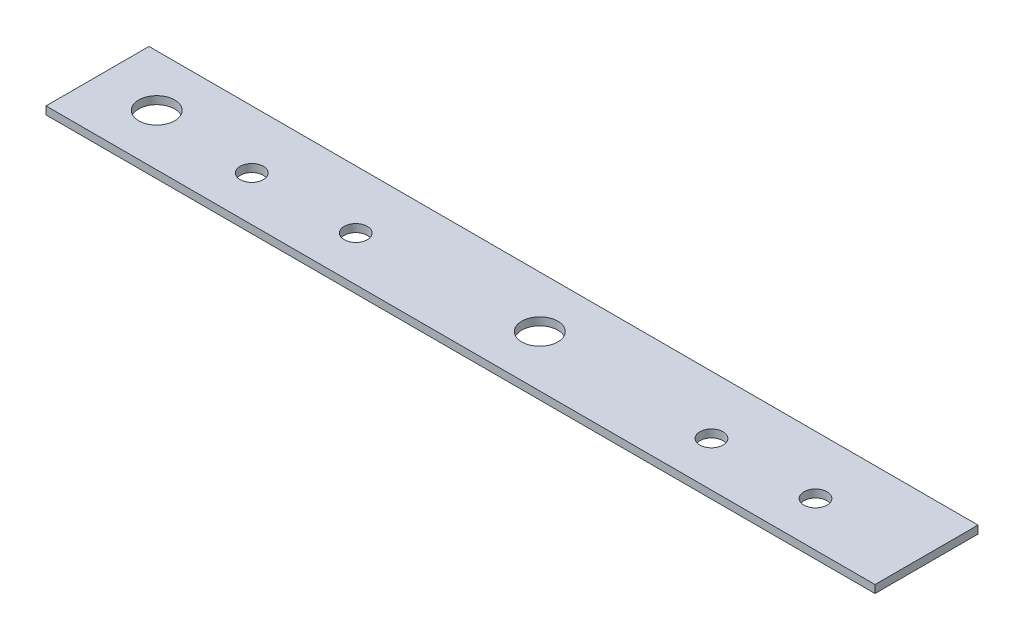
ISO-10303-21;
HEADER;
FILE_DESCRIPTION(('STEP AP214'),'2;1');
FILE_NAME('part.step','',(''),(''),'','','');
FILE_SCHEMA(('AUTOMOTIVE_DESIGN { 1 0 10303 214 1 1 1 1 }'));
ENDSEC;
DATA;
#1=APPLICATION_CONTEXT('core data for automotive mechanical design processes');
#2=APPLICATION_PROTOCOL_DEFINITION('international standard','automotive_design',2000,#1);
#3=PRODUCT_CONTEXT('',#1,'mechanical');
#4=PRODUCT('Part','Part','',(#3));
#5=PRODUCT_RELATED_PRODUCT_CATEGORY('part','',(#4));
#6=PRODUCT_DEFINITION_FORMATION('','',#4);
#7=PRODUCT_DEFINITION_CONTEXT('part definition',#1,'design');
#8=PRODUCT_DEFINITION('design','',#6,#7);
#9=PRODUCT_DEFINITION_SHAPE('','',#8);
#10=(LENGTH_UNIT() NAMED_UNIT(*) SI_UNIT(.MILLI.,.METRE.));
#11=(NAMED_UNIT(*) PLANE_ANGLE_UNIT() SI_UNIT($,.RADIAN.));
#12=(NAMED_UNIT(*) SI_UNIT($,.STERADIAN.) SOLID_ANGLE_UNIT());
#13=UNCERTAINTY_MEASURE_WITH_UNIT(LENGTH_MEASURE(1.E-05),#10,'distance_accuracy_value','');
#14=(GEOMETRIC_REPRESENTATION_CONTEXT(3) GLOBAL_UNCERTAINTY_ASSIGNED_CONTEXT((#13)) GLOBAL_UNIT_ASSIGNED_CONTEXT((#10,
#11,#12)) REPRESENTATION_CONTEXT('',''));
#15=CARTESIAN_POINT('',(0.,0.,0.));
#16=DIRECTION('',(0.,0.,1.));
#17=DIRECTION('',(1.,0.,0.));
#18=AXIS2_PLACEMENT_3D('',#15,#16,#17);
#19=CARTESIAN_POINT('',(40.25,0.38,5.));
#20=DIRECTION('',(0.,1.,0.));
#21=DIRECTION('',(0.,0.,1.));
#22=AXIS2_PLACEMENT_3D('',#19,#20,#21);
#23=PLANE('',#22);
#24=CARTESIAN_POINT('',(20.02,0.38,0.65));
#25=DIRECTION('',(0.,1.,0.));
#26=DIRECTION('',(0.,0.,1.));
#27=AXIS2_PLACEMENT_3D('',#24,#25,#26);
#28=CIRCLE('',#27,1.125);
#29=CARTESIAN_POINT('',(20.02,0.38,1.775));
#30=VERTEX_POINT('',#29);
#31=EDGE_CURVE('E133',#30,#30,#28,.T.);
#32=ORIENTED_EDGE('',*,*,#31,.F.);
#33=EDGE_LOOP('',(#32));
#34=FACE_BOUND('',#33,.T.);
#35=CARTESIAN_POINT('',(-24.62,0.38,0.65));
#36=DIRECTION('',(0.,1.,0.));
#37=DIRECTION('',(0.,0.,1.));
#38=AXIS2_PLACEMENT_3D('',#35,#36,#37);
#39=CIRCLE('',#38,1.125);
#40=CARTESIAN_POINT('',(-24.62,0.38,1.775));
#41=VERTEX_POINT('',#40);
#42=EDGE_CURVE('E121',#41,#41,#39,.T.);
#43=ORIENTED_EDGE('',*,*,#42,.F.);
#44=EDGE_LOOP('',(#43));
#45=FACE_BOUND('',#44,.T.);
#46=CARTESIAN_POINT('',(-34.5,0.38,0.));
#47=DIRECTION('',(0.,1.,0.));
#48=DIRECTION('',(0.,0.,1.));
#49=AXIS2_PLACEMENT_3D('',#46,#47,#48);
#50=CIRCLE('',#49,1.75);
#51=CARTESIAN_POINT('',(-34.5,0.38,1.75));
#52=VERTEX_POINT('',#51);
#53=EDGE_CURVE('E100',#52,#52,#50,.T.);
#54=ORIENTED_EDGE('',*,*,#53,.F.);
#55=EDGE_LOOP('',(#54));
#56=FACE_BOUND('',#55,.T.);
#57=DIRECTION('',(0.,0.,-1.));
#58=VECTOR('',#57,1.);
#59=CARTESIAN_POINT('',(40.25,0.38,-5.));
#60=LINE('',#59,#58);
#61=CARTESIAN_POINT('',(40.25,0.38,5.));
#62=VERTEX_POINT('',#61);
#63=CARTESIAN_POINT('',(40.25,0.38,-5.));
#64=VERTEX_POINT('',#63);
#65=EDGE_CURVE('E85',#62,#64,#60,.T.);
#66=ORIENTED_EDGE('',*,*,#65,.T.);
#67=DIRECTION('',(-1.,0.,0.));
#68=VECTOR('',#67,1.);
#69=CARTESIAN_POINT('',(-40.25,0.38,-5.));
#70=LINE('',#69,#68);
#71=CARTESIAN_POINT('',(-40.25,0.38,-5.));
#72=VERTEX_POINT('',#71);
#73=EDGE_CURVE('E80',#64,#72,#70,.T.);
#74=ORIENTED_EDGE('',*,*,#73,.T.);
#75=DIRECTION('',(0.,0.,1.));
#76=VECTOR('',#75,1.);
#77=CARTESIAN_POINT('',(-40.25,0.38,-5.));
#78=LINE('',#77,#76);
#79=CARTESIAN_POINT('',(-40.25,0.38,5.));
#80=VERTEX_POINT('',#79);
#81=EDGE_CURVE('E83',#72,#80,#78,.T.);
#82=ORIENTED_EDGE('',*,*,#81,.T.);
#83=DIRECTION('',(1.,0.,0.));
#84=VECTOR('',#83,1.);
#85=CARTESIAN_POINT('',(-40.25,0.38,5.));
#86=LINE('',#85,#84);
#87=EDGE_CURVE('E50',#80,#62,#86,.T.);
#88=ORIENTED_EDGE('',*,*,#87,.T.);
#89=EDGE_LOOP('',(#66,#74,#82,#88));
#90=FACE_BOUND('',#89,.T.);
#91=CARTESIAN_POINT('',(-14.52,0.38,0.65));
#92=DIRECTION('',(0.,1.,0.));
#93=DIRECTION('',(0.,0.,1.));
#94=AXIS2_PLACEMENT_3D('',#91,#92,#93);
#95=CIRCLE('',#94,1.125);
#96=CARTESIAN_POINT('',(-14.52,0.38,1.775));
#97=VERTEX_POINT('',#96);
#98=EDGE_CURVE('E115',#97,#97,#95,.T.);
#99=ORIENTED_EDGE('',*,*,#98,.F.);
#100=EDGE_LOOP('',(#99));
#101=FACE_BOUND('',#100,.T.);
#102=CARTESIAN_POINT('',(2.70000000000001,0.38,0.));
#103=DIRECTION('',(0.,1.,0.));
#104=DIRECTION('',(0.,0.,1.));
#105=AXIS2_PLACEMENT_3D('',#102,#103,#104);
#106=CIRCLE('',#105,1.75);
#107=CARTESIAN_POINT('',(2.70000000000001,0.38,1.75));
#108=VERTEX_POINT('',#107);
#109=EDGE_CURVE('E127',#108,#108,#106,.T.);
#110=ORIENTED_EDGE('',*,*,#109,.F.);
#111=EDGE_LOOP('',(#110));
#112=FACE_BOUND('',#111,.T.);
#113=CARTESIAN_POINT('',(30.12,0.38,0.65));
#114=DIRECTION('',(0.,1.,0.));
#115=DIRECTION('',(0.,0.,1.));
#116=AXIS2_PLACEMENT_3D('',#113,#114,#115);
#117=CIRCLE('',#116,1.125);
#118=CARTESIAN_POINT('',(30.12,0.38,1.775));
#119=VERTEX_POINT('',#118);
#120=EDGE_CURVE('E139',#119,#119,#117,.T.);
#121=ORIENTED_EDGE('',*,*,#120,.F.);
#122=EDGE_LOOP('',(#121));
#123=FACE_BOUND('',#122,.T.);
#124=ADVANCED_FACE('F33',(#34,#45,#56,#90,#101,#112,#123),#23,.T.);
#125=CARTESIAN_POINT('',(40.25,-0.38,5.));
#126=DIRECTION('',(0.,1.,0.));
#127=DIRECTION('',(0.,0.,1.));
#128=AXIS2_PLACEMENT_3D('',#125,#126,#127);
#129=PLANE('',#128);
#130=CARTESIAN_POINT('',(20.02,-0.38,0.65));
#131=DIRECTION('',(0.,1.,0.));
#132=DIRECTION('',(0.,0.,1.));
#133=AXIS2_PLACEMENT_3D('',#130,#131,#132);
#134=CIRCLE('',#133,1.125);
#135=CARTESIAN_POINT('',(20.02,-0.38,1.775));
#136=VERTEX_POINT('',#135);
#137=EDGE_CURVE('E136',#136,#136,#134,.T.);
#138=ORIENTED_EDGE('',*,*,#137,.T.);
#139=EDGE_LOOP('',(#138));
#140=FACE_BOUND('',#139,.T.);
#141=CARTESIAN_POINT('',(-24.62,-0.38,0.65));
#142=DIRECTION('',(0.,1.,0.));
#143=DIRECTION('',(0.,0.,1.));
#144=AXIS2_PLACEMENT_3D('',#141,#142,#143);
#145=CIRCLE('',#144,1.125);
#146=CARTESIAN_POINT('',(-24.62,-0.38,1.775));
#147=VERTEX_POINT('',#146);
#148=EDGE_CURVE('E124',#147,#147,#145,.T.);
#149=ORIENTED_EDGE('',*,*,#148,.T.);
#150=EDGE_LOOP('',(#149));
#151=FACE_BOUND('',#150,.T.);
#152=CARTESIAN_POINT('',(-34.5,-0.38,0.));
#153=DIRECTION('',(0.,1.,0.));
#154=DIRECTION('',(0.,0.,1.));
#155=AXIS2_PLACEMENT_3D('',#152,#153,#154);
#156=CIRCLE('',#155,1.75);
#157=CARTESIAN_POINT('',(-34.5,-0.38,1.75));
#158=VERTEX_POINT('',#157);
#159=EDGE_CURVE('E112',#158,#158,#156,.T.);
#160=ORIENTED_EDGE('',*,*,#159,.T.);
#161=EDGE_LOOP('',(#160));
#162=FACE_BOUND('',#161,.T.);
#163=DIRECTION('',(0.,0.,-1.));
#164=VECTOR('',#163,1.);
#165=CARTESIAN_POINT('',(40.25,-0.38,-5.));
#166=LINE('',#165,#164);
#167=CARTESIAN_POINT('',(40.25,-0.38,5.));
#168=VERTEX_POINT('',#167);
#169=CARTESIAN_POINT('',(40.25,-0.38,-5.));
#170=VERTEX_POINT('',#169);
#171=EDGE_CURVE('E97',#168,#170,#166,.T.);
#172=ORIENTED_EDGE('',*,*,#171,.F.);
#173=DIRECTION('',(1.,0.,0.));
#174=VECTOR('',#173,1.);
#175=CARTESIAN_POINT('',(-40.25,-0.38,5.));
#176=LINE('',#175,#174);
#177=CARTESIAN_POINT('',(-40.25,-0.38,5.));
#178=VERTEX_POINT('',#177);
#179=EDGE_CURVE('E73',#178,#168,#176,.T.);
#180=ORIENTED_EDGE('',*,*,#179,.F.);
#181=DIRECTION('',(0.,0.,1.));
#182=VECTOR('',#181,1.);
#183=CARTESIAN_POINT('',(-40.25,-0.38,-5.));
#184=LINE('',#183,#182);
#185=CARTESIAN_POINT('',(-40.25,-0.38,-5.));
#186=VERTEX_POINT('',#185);
#187=EDGE_CURVE('E67',#186,#178,#184,.T.);
#188=ORIENTED_EDGE('',*,*,#187,.F.);
#189=DIRECTION('',(-1.,0.,0.));
#190=VECTOR('',#189,1.);
#191=CARTESIAN_POINT('',(-40.25,-0.38,-5.));
#192=LINE('',#191,#190);
#193=EDGE_CURVE('E89',#170,#186,#192,.T.);
#194=ORIENTED_EDGE('',*,*,#193,.F.);
#195=EDGE_LOOP('',(#172,#180,#188,#194));
#196=FACE_BOUND('',#195,.T.);
#197=CARTESIAN_POINT('',(-14.52,-0.38,0.65));
#198=DIRECTION('',(0.,1.,0.));
#199=DIRECTION('',(0.,0.,1.));
#200=AXIS2_PLACEMENT_3D('',#197,#198,#199);
#201=CIRCLE('',#200,1.125);
#202=CARTESIAN_POINT('',(-14.52,-0.38,1.775));
#203=VERTEX_POINT('',#202);
#204=EDGE_CURVE('E118',#203,#203,#201,.T.);
#205=ORIENTED_EDGE('',*,*,#204,.T.);
#206=EDGE_LOOP('',(#205));
#207=FACE_BOUND('',#206,.T.);
#208=CARTESIAN_POINT('',(2.70000000000001,-0.38,0.));
#209=DIRECTION('',(0.,1.,0.));
#210=DIRECTION('',(0.,0.,1.));
#211=AXIS2_PLACEMENT_3D('',#208,#209,#210);
#212=CIRCLE('',#211,1.75);
#213=CARTESIAN_POINT('',(2.70000000000001,-0.38,1.75));
#214=VERTEX_POINT('',#213);
#215=EDGE_CURVE('E130',#214,#214,#212,.T.);
#216=ORIENTED_EDGE('',*,*,#215,.T.);
#217=EDGE_LOOP('',(#216));
#218=FACE_BOUND('',#217,.T.);
#219=CARTESIAN_POINT('',(30.12,-0.38,0.65));
#220=DIRECTION('',(0.,1.,0.));
#221=DIRECTION('',(0.,0.,1.));
#222=AXIS2_PLACEMENT_3D('',#219,#220,#221);
#223=CIRCLE('',#222,1.125);
#224=CARTESIAN_POINT('',(30.12,-0.38,1.775));
#225=VERTEX_POINT('',#224);
#226=EDGE_CURVE('E142',#225,#225,#223,.T.);
#227=ORIENTED_EDGE('',*,*,#226,.T.);
#228=EDGE_LOOP('',(#227));
#229=FACE_BOUND('',#228,.T.);
#230=ADVANCED_FACE('F108',(#140,#151,#162,#196,#207,#218,#229),#129,.F.);
#231=CARTESIAN_POINT('',(40.25,0.38,-5.));
#232=DIRECTION('',(-1.,0.,0.));
#233=DIRECTION('',(0.,0.,1.));
#234=AXIS2_PLACEMENT_3D('',#231,#232,#233);
#235=PLANE('',#234);
#236=ORIENTED_EDGE('',*,*,#171,.T.);
#237=DIRECTION('',(0.,-1.,0.));
#238=VECTOR('',#237,1.);
#239=CARTESIAN_POINT('',(40.25,0.38,-5.));
#240=LINE('',#239,#238);
#241=EDGE_CURVE('E11',#64,#170,#240,.T.);
#242=ORIENTED_EDGE('',*,*,#241,.F.);
#243=ORIENTED_EDGE('',*,*,#65,.F.);
#244=DIRECTION('',(0.,-1.,0.));
#245=VECTOR('',#244,1.);
#246=CARTESIAN_POINT('',(40.25,0.38,5.));
#247=LINE('',#246,#245);
#248=EDGE_CURVE('E93',#62,#168,#247,.T.);
#249=ORIENTED_EDGE('',*,*,#248,.T.);
#250=EDGE_LOOP('',(#236,#242,#243,#249));
#251=FACE_BOUND('',#250,.T.);
#252=ADVANCED_FACE('F35',(#251),#235,.F.);
#253=CARTESIAN_POINT('',(-40.25,0.38,-5.));
#254=DIRECTION('',(0.,0.,1.));
#255=DIRECTION('',(1.,0.,0.));
#256=AXIS2_PLACEMENT_3D('',#253,#254,#255);
#257=PLANE('',#256);
#258=ORIENTED_EDGE('',*,*,#193,.T.);
#259=DIRECTION('',(0.,-1.,0.));
#260=VECTOR('',#259,1.);
#261=CARTESIAN_POINT('',(-40.25,0.38,-5.));
#262=LINE('',#261,#260);
#263=EDGE_CURVE('E42',#72,#186,#262,.T.);
#264=ORIENTED_EDGE('',*,*,#263,.F.);
#265=ORIENTED_EDGE('',*,*,#73,.F.);
#266=ORIENTED_EDGE('',*,*,#241,.T.);
#267=EDGE_LOOP('',(#258,#264,#265,#266));
#268=FACE_BOUND('',#267,.T.);
#269=ADVANCED_FACE('F88',(#268),#257,.F.);
#270=CARTESIAN_POINT('',(-40.25,0.38,-5.));
#271=DIRECTION('',(1.,0.,0.));
#272=DIRECTION('',(0.,0.,-1.));
#273=AXIS2_PLACEMENT_3D('',#270,#271,#272);
#274=PLANE('',#273);
#275=ORIENTED_EDGE('',*,*,#187,.T.);
#276=DIRECTION('',(0.,-1.,0.));
#277=VECTOR('',#276,1.);
#278=CARTESIAN_POINT('',(-40.25,0.38,5.));
#279=LINE('',#278,#277);
#280=EDGE_CURVE('E90',#80,#178,#279,.T.);
#281=ORIENTED_EDGE('',*,*,#280,.F.);
#282=ORIENTED_EDGE('',*,*,#81,.F.);
#283=ORIENTED_EDGE('',*,*,#263,.T.);
#284=EDGE_LOOP('',(#275,#281,#282,#283));
#285=FACE_BOUND('',#284,.T.);
#286=ADVANCED_FACE('F91',(#285),#274,.F.);
#287=CARTESIAN_POINT('',(-40.25,0.38,5.));
#288=DIRECTION('',(0.,0.,-1.));
#289=DIRECTION('',(-1.,0.,0.));
#290=AXIS2_PLACEMENT_3D('',#287,#288,#289);
#291=PLANE('',#290);
#292=ORIENTED_EDGE('',*,*,#179,.T.);
#293=ORIENTED_EDGE('',*,*,#248,.F.);
#294=ORIENTED_EDGE('',*,*,#87,.F.);
#295=ORIENTED_EDGE('',*,*,#280,.T.);
#296=EDGE_LOOP('',(#292,#293,#294,#295));
#297=FACE_BOUND('',#296,.T.);
#298=ADVANCED_FACE('F105',(#297),#291,.F.);
#299=CARTESIAN_POINT('',(-34.5,0.38,0.));
#300=DIRECTION('',(0.,-1.,0.));
#301=DIRECTION('',(0.,0.,-1.));
#302=AXIS2_PLACEMENT_3D('',#299,#300,#301);
#303=CYLINDRICAL_SURFACE('',#302,1.75);
#304=ORIENTED_EDGE('',*,*,#53,.T.);
#305=EDGE_LOOP('',(#304));
#306=FACE_BOUND('',#305,.T.);
#307=ORIENTED_EDGE('',*,*,#159,.F.);
#308=EDGE_LOOP('',(#307));
#309=FACE_BOUND('',#308,.T.);
#310=ADVANCED_FACE('F162',(#306,#309),#303,.F.);
#311=CARTESIAN_POINT('',(-14.52,0.38,0.65));
#312=DIRECTION('',(0.,-1.,0.));
#313=DIRECTION('',(0.,0.,-1.));
#314=AXIS2_PLACEMENT_3D('',#311,#312,#313);
#315=CYLINDRICAL_SURFACE('',#314,1.125);
#316=ORIENTED_EDGE('',*,*,#98,.T.);
#317=EDGE_LOOP('',(#316));
#318=FACE_BOUND('',#317,.T.);
#319=ORIENTED_EDGE('',*,*,#204,.F.);
#320=EDGE_LOOP('',(#319));
#321=FACE_BOUND('',#320,.T.);
#322=ADVANCED_FACE('F208',(#318,#321),#315,.F.);
#323=CARTESIAN_POINT('',(-24.62,0.38,0.65));
#324=DIRECTION('',(0.,-1.,0.));
#325=DIRECTION('',(0.,0.,-1.));
#326=AXIS2_PLACEMENT_3D('',#323,#324,#325);
#327=CYLINDRICAL_SURFACE('',#326,1.125);
#328=ORIENTED_EDGE('',*,*,#42,.T.);
#329=EDGE_LOOP('',(#328));
#330=FACE_BOUND('',#329,.T.);
#331=ORIENTED_EDGE('',*,*,#148,.F.);
#332=EDGE_LOOP('',(#331));
#333=FACE_BOUND('',#332,.T.);
#334=ADVANCED_FACE('F216',(#330,#333),#327,.F.);
#335=CARTESIAN_POINT('',(2.70000000000001,0.38,0.));
#336=DIRECTION('',(0.,-1.,0.));
#337=DIRECTION('',(0.,0.,-1.));
#338=AXIS2_PLACEMENT_3D('',#335,#336,#337);
#339=CYLINDRICAL_SURFACE('',#338,1.75);
#340=ORIENTED_EDGE('',*,*,#109,.T.);
#341=EDGE_LOOP('',(#340));
#342=FACE_BOUND('',#341,.T.);
#343=ORIENTED_EDGE('',*,*,#215,.F.);
#344=EDGE_LOOP('',(#343));
#345=FACE_BOUND('',#344,.T.);
#346=ADVANCED_FACE('F224',(#342,#345),#339,.F.);
#347=CARTESIAN_POINT('',(20.02,0.38,0.65));
#348=DIRECTION('',(0.,-1.,0.));
#349=DIRECTION('',(0.,0.,-1.));
#350=AXIS2_PLACEMENT_3D('',#347,#348,#349);
#351=CYLINDRICAL_SURFACE('',#350,1.125);
#352=ORIENTED_EDGE('',*,*,#31,.T.);
#353=EDGE_LOOP('',(#352));
#354=FACE_BOUND('',#353,.T.);
#355=ORIENTED_EDGE('',*,*,#137,.F.);
#356=EDGE_LOOP('',(#355));
#357=FACE_BOUND('',#356,.T.);
#358=ADVANCED_FACE('F233',(#354,#357),#351,.F.);
#359=CARTESIAN_POINT('',(30.12,0.38,0.65));
#360=DIRECTION('',(0.,-1.,0.));
#361=DIRECTION('',(0.,0.,-1.));
#362=AXIS2_PLACEMENT_3D('',#359,#360,#361);
#363=CYLINDRICAL_SURFACE('',#362,1.125);
#364=ORIENTED_EDGE('',*,*,#120,.T.);
#365=EDGE_LOOP('',(#364));
#366=FACE_BOUND('',#365,.T.);
#367=ORIENTED_EDGE('',*,*,#226,.F.);
#368=EDGE_LOOP('',(#367));
#369=FACE_BOUND('',#368,.T.);
#370=ADVANCED_FACE('F148',(#366,#369),#363,.F.);
#371=CLOSED_SHELL('',(#124,#230,#252,#269,#286,#298,#310,#322,#334,#346,#358,#370));
#372=MANIFOLD_SOLID_BREP('B2',#371);
#373=ADVANCED_BREP_SHAPE_REPRESENTATION('',(#18,#372),#14);
#374=SHAPE_DEFINITION_REPRESENTATION(#9,#373);
ENDSEC;
END-ISO-10303-21;
